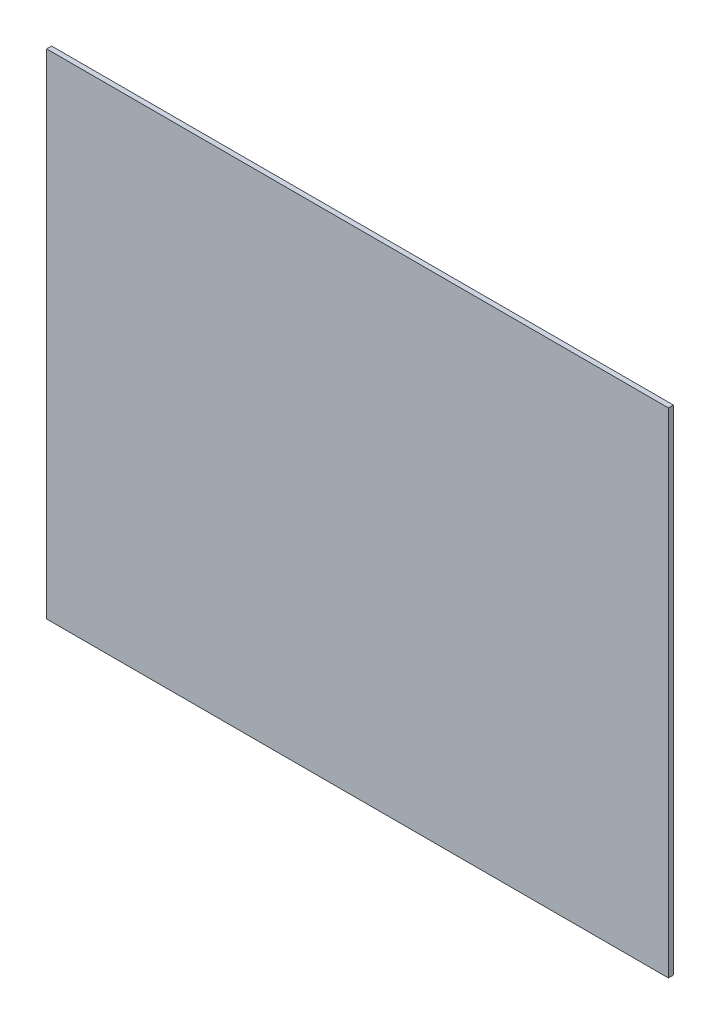
ISO-10303-21;
HEADER;
FILE_DESCRIPTION(('STEP AP214'),'2;1');
FILE_NAME('part.step','',(''),(''),'','','');
FILE_SCHEMA(('AUTOMOTIVE_DESIGN { 1 0 10303 214 1 1 1 1 }'));
ENDSEC;
DATA;
#1=APPLICATION_CONTEXT('core data for automotive mechanical design processes');
#2=APPLICATION_PROTOCOL_DEFINITION('international standard','automotive_design',2000,#1);
#3=PRODUCT_CONTEXT('',#1,'mechanical');
#4=PRODUCT('Part','Part','',(#3));
#5=PRODUCT_RELATED_PRODUCT_CATEGORY('part','',(#4));
#6=PRODUCT_DEFINITION_FORMATION('','',#4);
#7=PRODUCT_DEFINITION_CONTEXT('part definition',#1,'design');
#8=PRODUCT_DEFINITION('design','',#6,#7);
#9=PRODUCT_DEFINITION_SHAPE('','',#8);
#10=(LENGTH_UNIT() NAMED_UNIT(*) SI_UNIT(.MILLI.,.METRE.));
#11=(NAMED_UNIT(*) PLANE_ANGLE_UNIT() SI_UNIT($,.RADIAN.));
#12=(NAMED_UNIT(*) SI_UNIT($,.STERADIAN.) SOLID_ANGLE_UNIT());
#13=UNCERTAINTY_MEASURE_WITH_UNIT(LENGTH_MEASURE(1.E-05),#10,'distance_accuracy_value','');
#14=(GEOMETRIC_REPRESENTATION_CONTEXT(3) GLOBAL_UNCERTAINTY_ASSIGNED_CONTEXT((#13)) GLOBAL_UNIT_ASSIGNED_CONTEXT((#10,
#11,#12)) REPRESENTATION_CONTEXT('',''));
#15=CARTESIAN_POINT('',(0.,0.,0.));
#16=DIRECTION('',(0.,0.,1.));
#17=DIRECTION('',(1.,0.,0.));
#18=AXIS2_PLACEMENT_3D('',#15,#16,#17);
#19=CARTESIAN_POINT('',(125.,99.2499999999999,2.));
#20=DIRECTION('',(-1.,0.,0.));
#21=DIRECTION('',(0.,-1.,0.));
#22=AXIS2_PLACEMENT_3D('',#19,#20,#21);
#23=PLANE('',#22);
#24=DIRECTION('',(0.,1.,0.));
#25=VECTOR('',#24,1.);
#26=CARTESIAN_POINT('',(125.,99.2499999999999,0.));
#27=LINE('',#26,#25);
#28=CARTESIAN_POINT('',(125.,-99.2500000000001,0.));
#29=VERTEX_POINT('',#28);
#30=CARTESIAN_POINT('',(125.,99.2499999999999,0.));
#31=VERTEX_POINT('',#30);
#32=EDGE_CURVE('E96',#29,#31,#27,.T.);
#33=ORIENTED_EDGE('',*,*,#32,.T.);
#34=DIRECTION('',(0.,0.,-1.));
#35=VECTOR('',#34,1.);
#36=CARTESIAN_POINT('',(125.,99.2499999999999,2.));
#37=LINE('',#36,#35);
#38=CARTESIAN_POINT('',(125.,99.2499999999999,2.));
#39=VERTEX_POINT('',#38);
#40=EDGE_CURVE('E11',#39,#31,#37,.T.);
#41=ORIENTED_EDGE('',*,*,#40,.F.);
#42=DIRECTION('',(0.,1.,0.));
#43=VECTOR('',#42,1.);
#44=CARTESIAN_POINT('',(125.,99.2499999999999,2.));
#45=LINE('',#44,#43);
#46=CARTESIAN_POINT('',(125.,-99.2500000000001,2.));
#47=VERTEX_POINT('',#46);
#48=EDGE_CURVE('E84',#47,#39,#45,.T.);
#49=ORIENTED_EDGE('',*,*,#48,.F.);
#50=DIRECTION('',(0.,0.,-1.));
#51=VECTOR('',#50,1.);
#52=CARTESIAN_POINT('',(125.,-99.2500000000001,2.));
#53=LINE('',#52,#51);
#54=EDGE_CURVE('E92',#47,#29,#53,.T.);
#55=ORIENTED_EDGE('',*,*,#54,.T.);
#56=EDGE_LOOP('',(#33,#41,#49,#55));
#57=FACE_BOUND('',#56,.T.);
#58=ADVANCED_FACE('F33',(#57),#23,.F.);
#59=CARTESIAN_POINT('',(-125.,99.2499999999999,2.));
#60=DIRECTION('',(0.,-1.,0.));
#61=DIRECTION('',(0.,0.,-1.));
#62=AXIS2_PLACEMENT_3D('',#59,#60,#61);
#63=PLANE('',#62);
#64=DIRECTION('',(-1.,0.,0.));
#65=VECTOR('',#64,1.);
#66=CARTESIAN_POINT('',(-125.,99.2499999999999,0.));
#67=LINE('',#66,#65);
#68=CARTESIAN_POINT('',(-125.,99.2499999999999,0.));
#69=VERTEX_POINT('',#68);
#70=EDGE_CURVE('E88',#31,#69,#67,.T.);
#71=ORIENTED_EDGE('',*,*,#70,.T.);
#72=DIRECTION('',(0.,0.,-1.));
#73=VECTOR('',#72,1.);
#74=CARTESIAN_POINT('',(-125.,99.2499999999999,2.));
#75=LINE('',#74,#73);
#76=CARTESIAN_POINT('',(-125.,99.2499999999999,2.));
#77=VERTEX_POINT('',#76);
#78=EDGE_CURVE('E41',#77,#69,#75,.T.);
#79=ORIENTED_EDGE('',*,*,#78,.F.);
#80=DIRECTION('',(-1.,0.,0.));
#81=VECTOR('',#80,1.);
#82=CARTESIAN_POINT('',(-125.,99.2499999999999,2.));
#83=LINE('',#82,#81);
#84=EDGE_CURVE('E79',#39,#77,#83,.T.);
#85=ORIENTED_EDGE('',*,*,#84,.F.);
#86=ORIENTED_EDGE('',*,*,#40,.T.);
#87=EDGE_LOOP('',(#71,#79,#85,#86));
#88=FACE_BOUND('',#87,.T.);
#89=ADVANCED_FACE('F87',(#88),#63,.F.);
#90=CARTESIAN_POINT('',(-125.,99.2499999999999,2.));
#91=DIRECTION('',(1.,0.,0.));
#92=DIRECTION('',(0.,1.,0.));
#93=AXIS2_PLACEMENT_3D('',#90,#91,#92);
#94=PLANE('',#93);
#95=DIRECTION('',(0.,-1.,0.));
#96=VECTOR('',#95,1.);
#97=CARTESIAN_POINT('',(-125.,99.2499999999999,0.));
#98=LINE('',#97,#96);
#99=CARTESIAN_POINT('',(-125.,-99.2500000000001,0.));
#100=VERTEX_POINT('',#99);
#101=EDGE_CURVE('E66',#69,#100,#98,.T.);
#102=ORIENTED_EDGE('',*,*,#101,.T.);
#103=DIRECTION('',(0.,0.,-1.));
#104=VECTOR('',#103,1.);
#105=CARTESIAN_POINT('',(-125.,-99.2500000000001,2.));
#106=LINE('',#105,#104);
#107=CARTESIAN_POINT('',(-125.,-99.2500000000001,2.));
#108=VERTEX_POINT('',#107);
#109=EDGE_CURVE('E89',#108,#100,#106,.T.);
#110=ORIENTED_EDGE('',*,*,#109,.F.);
#111=DIRECTION('',(0.,-1.,0.));
#112=VECTOR('',#111,1.);
#113=CARTESIAN_POINT('',(-125.,99.2499999999999,2.));
#114=LINE('',#113,#112);
#115=EDGE_CURVE('E82',#77,#108,#114,.T.);
#116=ORIENTED_EDGE('',*,*,#115,.F.);
#117=ORIENTED_EDGE('',*,*,#78,.T.);
#118=EDGE_LOOP('',(#102,#110,#116,#117));
#119=FACE_BOUND('',#118,.T.);
#120=ADVANCED_FACE('F90',(#119),#94,.F.);
#121=CARTESIAN_POINT('',(-125.,-99.2500000000001,2.));
#122=DIRECTION('',(0.,1.,0.));
#123=DIRECTION('',(0.,0.,1.));
#124=AXIS2_PLACEMENT_3D('',#121,#122,#123);
#125=PLANE('',#124);
#126=DIRECTION('',(1.,0.,0.));
#127=VECTOR('',#126,1.);
#128=CARTESIAN_POINT('',(-125.,-99.2500000000001,0.));
#129=LINE('',#128,#127);
#130=EDGE_CURVE('E72',#100,#29,#129,.T.);
#131=ORIENTED_EDGE('',*,*,#130,.T.);
#132=ORIENTED_EDGE('',*,*,#54,.F.);
#133=DIRECTION('',(1.,0.,0.));
#134=VECTOR('',#133,1.);
#135=CARTESIAN_POINT('',(-125.,-99.2500000000001,2.));
#136=LINE('',#135,#134);
#137=EDGE_CURVE('E49',#108,#47,#136,.T.);
#138=ORIENTED_EDGE('',*,*,#137,.F.);
#139=ORIENTED_EDGE('',*,*,#109,.T.);
#140=EDGE_LOOP('',(#131,#132,#138,#139));
#141=FACE_BOUND('',#140,.T.);
#142=ADVANCED_FACE('F103',(#141),#125,.F.);
#143=CARTESIAN_POINT('',(0.,0.,2.));
#144=DIRECTION('',(0.,0.,1.));
#145=DIRECTION('',(1.,0.,0.));
#146=AXIS2_PLACEMENT_3D('',#143,#144,#145);
#147=PLANE('',#146);
#148=ORIENTED_EDGE('',*,*,#48,.T.);
#149=ORIENTED_EDGE('',*,*,#84,.T.);
#150=ORIENTED_EDGE('',*,*,#115,.T.);
#151=ORIENTED_EDGE('',*,*,#137,.T.);
#152=EDGE_LOOP('',(#148,#149,#150,#151));
#153=FACE_BOUND('',#152,.T.);
#154=ADVANCED_FACE('F80',(#153),#147,.T.);
#155=CARTESIAN_POINT('',(0.,0.,0.));
#156=DIRECTION('',(0.,0.,1.));
#157=DIRECTION('',(1.,0.,0.));
#158=AXIS2_PLACEMENT_3D('',#155,#156,#157);
#159=PLANE('',#158);
#160=ORIENTED_EDGE('',*,*,#32,.F.);
#161=ORIENTED_EDGE('',*,*,#130,.F.);
#162=ORIENTED_EDGE('',*,*,#101,.F.);
#163=ORIENTED_EDGE('',*,*,#70,.F.);
#164=EDGE_LOOP('',(#160,#161,#162,#163));
#165=FACE_BOUND('',#164,.T.);
#166=ADVANCED_FACE('F106',(#165),#159,.F.);
#167=CLOSED_SHELL('',(#58,#89,#120,#142,#154,#166));
#168=MANIFOLD_SOLID_BREP('B2',#167);
#169=ADVANCED_BREP_SHAPE_REPRESENTATION('',(#18,#168),#14);
#170=SHAPE_DEFINITION_REPRESENTATION(#9,#169);
ENDSEC;
END-ISO-10303-21;
